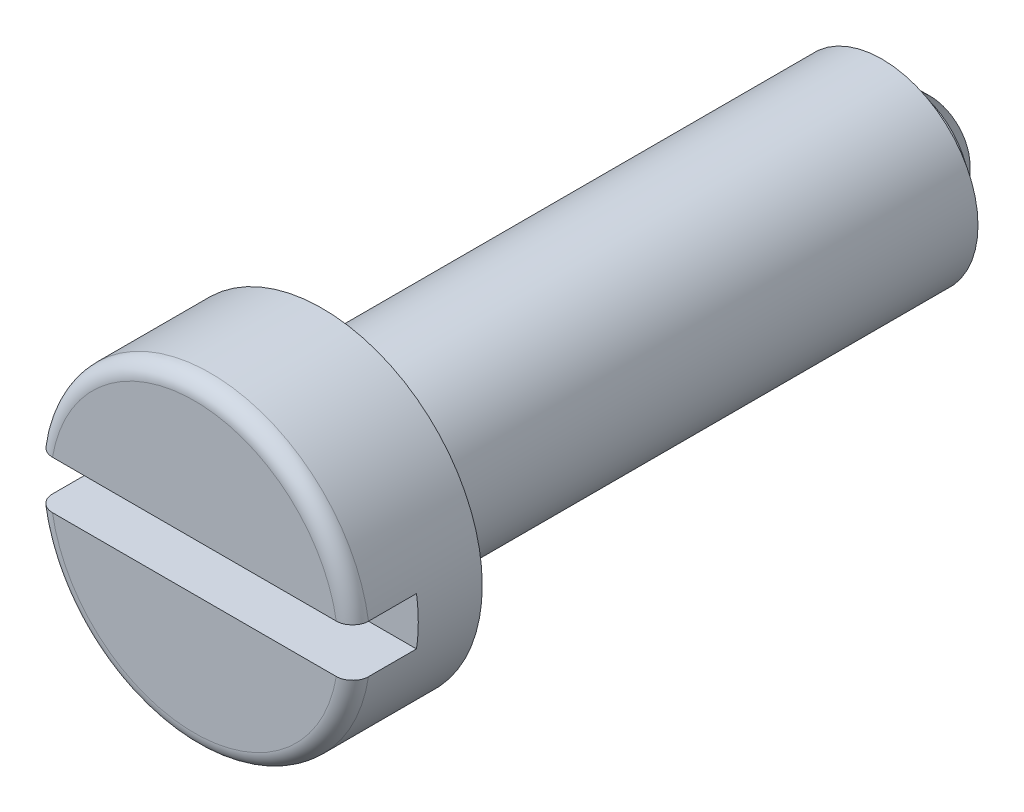
ISO-10303-21;
HEADER;
FILE_DESCRIPTION(('STEP AP214'),'2;1');
FILE_NAME('part.step','',(''),(''),'','','');
FILE_SCHEMA(('AUTOMOTIVE_DESIGN { 1 0 10303 214 1 1 1 1 }'));
ENDSEC;
DATA;
#1=APPLICATION_CONTEXT('core data for automotive mechanical design processes');
#2=APPLICATION_PROTOCOL_DEFINITION('international standard','automotive_design',2000,#1);
#3=PRODUCT_CONTEXT('',#1,'mechanical');
#4=PRODUCT('Part','Part','',(#3));
#5=PRODUCT_RELATED_PRODUCT_CATEGORY('part','',(#4));
#6=PRODUCT_DEFINITION_FORMATION('','',#4);
#7=PRODUCT_DEFINITION_CONTEXT('part definition',#1,'design');
#8=PRODUCT_DEFINITION('design','',#6,#7);
#9=PRODUCT_DEFINITION_SHAPE('','',#8);
#10=(LENGTH_UNIT() NAMED_UNIT(*) SI_UNIT(.MILLI.,.METRE.));
#11=(NAMED_UNIT(*) PLANE_ANGLE_UNIT() SI_UNIT($,.RADIAN.));
#12=(NAMED_UNIT(*) SI_UNIT($,.STERADIAN.) SOLID_ANGLE_UNIT());
#13=UNCERTAINTY_MEASURE_WITH_UNIT(LENGTH_MEASURE(1.E-05),#10,'distance_accuracy_value','');
#14=(GEOMETRIC_REPRESENTATION_CONTEXT(3) GLOBAL_UNCERTAINTY_ASSIGNED_CONTEXT((#13)) GLOBAL_UNIT_ASSIGNED_CONTEXT((#10,
#11,#12)) REPRESENTATION_CONTEXT('',''));
#15=CARTESIAN_POINT('',(0.,0.,0.));
#16=DIRECTION('',(0.,0.,1.));
#17=DIRECTION('',(1.,0.,0.));
#18=AXIS2_PLACEMENT_3D('',#15,#16,#17);
#19=CARTESIAN_POINT('',(0.,0.,-0.1));
#20=DIRECTION('',(0.,0.,-1.));
#21=DIRECTION('',(-1.,0.,0.));
#22=AXIS2_PLACEMENT_3D('',#19,#20,#21);
#23=TOROIDAL_SURFACE('',#22,0.9,0.1);
#24=CARTESIAN_POINT('',(0.887411967464941,-0.15,0.));
#25=CARTESIAN_POINT('',(0.926926603390641,-0.15,0.));
#26=CARTESIAN_POINT('',(0.957983689915386,-0.15,-0.030057713039219));
#27=CARTESIAN_POINT('',(0.988685996664551,-0.15,-0.0597720626184495));
#28=CARTESIAN_POINT('',(0.988685996664551,-0.15,-0.0999999999999371));
#29=B_SPLINE_CURVE_WITH_KNOTS('',2,(#24,#25,#26,#27,#28),.UNSPECIFIED.,.F.,.F.,(3,2,3),(0.,0.5,
1.),.UNSPECIFIED.);
#30=CARTESIAN_POINT('',(0.887411967464942,-0.15,0.));
#31=VERTEX_POINT('',#30);
#32=CARTESIAN_POINT('',(0.988685996664259,-0.15,-0.1));
#33=VERTEX_POINT('',#32);
#34=EDGE_CURVE('E146',#31,#33,#29,.T.);
#35=ORIENTED_EDGE('',*,*,#34,.F.);
#36=CARTESIAN_POINT('',(0.,0.,0.));
#37=DIRECTION('',(0.,0.,1.));
#38=DIRECTION('',(-1.,0.,0.));
#39=AXIS2_PLACEMENT_3D('',#36,#37,#38);
#40=CIRCLE('',#39,0.9);
#41=CARTESIAN_POINT('',(-0.887411967464942,-0.15,0.));
#42=VERTEX_POINT('',#41);
#43=EDGE_CURVE('E201',#42,#31,#40,.T.);
#44=ORIENTED_EDGE('',*,*,#43,.F.);
#45=CARTESIAN_POINT('',(-0.98868599666426,-0.15,-0.1));
#46=CARTESIAN_POINT('',(-0.98868599666426,-0.15,-0.060708177612476));
#47=CARTESIAN_POINT('',(-0.957979701417958,-0.15,-0.0300622207917125));
#48=CARTESIAN_POINT('',(-0.927858291510137,-0.15,8.39985633133145E-13));
#49=CARTESIAN_POINT('',(-0.887411967465139,-0.15,8.39985633133145E-13));
#50=B_SPLINE_CURVE_WITH_KNOTS('',2,(#45,#46,#47,#48,#49),.UNSPECIFIED.,.F.,.F.,(3,2,3),(0.,0.5,
1.),.UNSPECIFIED.);
#51=CARTESIAN_POINT('',(-0.98868599666426,-0.15,-0.1));
#52=VERTEX_POINT('',#51);
#53=EDGE_CURVE('E181',#52,#42,#50,.T.);
#54=ORIENTED_EDGE('',*,*,#53,.F.);
#55=CARTESIAN_POINT('',(0.,0.,-0.1));
#56=DIRECTION('',(0.,0.,-1.));
#57=DIRECTION('',(-1.,0.,0.));
#58=AXIS2_PLACEMENT_3D('',#55,#56,#57);
#59=CIRCLE('',#58,1.);
#60=EDGE_CURVE('E219',#33,#52,#59,.T.);
#61=ORIENTED_EDGE('',*,*,#60,.F.);
#62=EDGE_LOOP('',(#35,#44,#54,#61));
#63=FACE_BOUND('',#62,.T.);
#64=ADVANCED_FACE('F16',(#63),#23,.T.);
#65=CARTESIAN_POINT('',(0.,0.,-0.1));
#66=DIRECTION('',(0.,0.,-1.));
#67=DIRECTION('',(-1.,0.,0.));
#68=AXIS2_PLACEMENT_3D('',#65,#66,#67);
#69=TOROIDAL_SURFACE('',#68,0.9,0.1);
#70=CARTESIAN_POINT('',(-0.887411967464941,0.15,0.));
#71=CARTESIAN_POINT('',(-0.926926603390646,0.15,0.));
#72=CARTESIAN_POINT('',(-0.957983689915386,0.15,-0.030057713039219));
#73=CARTESIAN_POINT('',(-0.988685996664551,0.15,-0.0597720626184485));
#74=CARTESIAN_POINT('',(-0.988685996664551,0.15,-0.0999999999999375));
#75=B_SPLINE_CURVE_WITH_KNOTS('',2,(#70,#71,#72,#73,#74),.UNSPECIFIED.,.F.,.F.,(3,2,3),(0.,0.5,
1.),.UNSPECIFIED.);
#76=CARTESIAN_POINT('',(-0.887411967464942,0.15,0.));
#77=VERTEX_POINT('',#76);
#78=CARTESIAN_POINT('',(-0.98868599666426,0.149999999999998,-0.1));
#79=VERTEX_POINT('',#78);
#80=EDGE_CURVE('E27',#77,#79,#75,.T.);
#81=ORIENTED_EDGE('',*,*,#80,.F.);
#82=CARTESIAN_POINT('',(0.,0.,0.));
#83=DIRECTION('',(0.,0.,1.));
#84=DIRECTION('',(-1.,0.,0.));
#85=AXIS2_PLACEMENT_3D('',#82,#83,#84);
#86=CIRCLE('',#85,0.9);
#87=CARTESIAN_POINT('',(0.887411967464942,0.15,0.));
#88=VERTEX_POINT('',#87);
#89=EDGE_CURVE('E270',#88,#77,#86,.T.);
#90=ORIENTED_EDGE('',*,*,#89,.F.);
#91=CARTESIAN_POINT('',(0.988685996664259,0.15,-0.1));
#92=CARTESIAN_POINT('',(0.988685996664259,0.15,-0.06070817761247));
#93=CARTESIAN_POINT('',(0.957979701417958,0.15,-0.0300622207917125));
#94=CARTESIAN_POINT('',(0.927858291510131,0.15,8.39985633133145E-13));
#95=CARTESIAN_POINT('',(0.88741196746514,0.15,8.39985633133145E-13));
#96=B_SPLINE_CURVE_WITH_KNOTS('',2,(#91,#92,#93,#94,#95),.UNSPECIFIED.,.F.,.F.,(3,2,3),(0.,0.5,
1.),.UNSPECIFIED.);
#97=CARTESIAN_POINT('',(0.988685996664259,0.15,-0.1));
#98=VERTEX_POINT('',#97);
#99=EDGE_CURVE('E231',#98,#88,#96,.T.);
#100=ORIENTED_EDGE('',*,*,#99,.F.);
#101=CARTESIAN_POINT('',(0.,0.,-0.1));
#102=DIRECTION('',(0.,0.,-1.));
#103=DIRECTION('',(-1.,0.,0.));
#104=AXIS2_PLACEMENT_3D('',#101,#102,#103);
#105=CIRCLE('',#104,1.);
#106=EDGE_CURVE('E127',#79,#98,#105,.T.);
#107=ORIENTED_EDGE('',*,*,#106,.F.);
#108=EDGE_LOOP('',(#81,#90,#100,#107));
#109=FACE_BOUND('',#108,.T.);
#110=ADVANCED_FACE('F194',(#109),#69,.T.);
#111=CARTESIAN_POINT('',(0.,0.,-0.4));
#112=DIRECTION('',(0.,0.,-1.));
#113=DIRECTION('',(0.,-1.,0.));
#114=AXIS2_PLACEMENT_3D('',#111,#112,#113);
#115=PLANE('',#114);
#116=DIRECTION('',(-1.,0.,0.));
#117=VECTOR('',#116,1.);
#118=CARTESIAN_POINT('',(-0.988685996664259,-0.15,-0.4));
#119=LINE('',#118,#117);
#120=CARTESIAN_POINT('',(0.988685996664259,-0.15,-0.4));
#121=VERTEX_POINT('',#120);
#122=CARTESIAN_POINT('',(-0.98868599666426,-0.15,-0.4));
#123=VERTEX_POINT('',#122);
#124=EDGE_CURVE('E118',#121,#123,#119,.T.);
#125=ORIENTED_EDGE('',*,*,#124,.F.);
#126=CARTESIAN_POINT('',(0.,0.,-0.4));
#127=DIRECTION('',(0.,0.,-1.));
#128=DIRECTION('',(-1.,0.,0.));
#129=AXIS2_PLACEMENT_3D('',#126,#127,#128);
#130=CIRCLE('',#129,1.);
#131=CARTESIAN_POINT('',(0.988685996664259,0.15,-0.4));
#132=VERTEX_POINT('',#131);
#133=EDGE_CURVE('E116',#132,#121,#130,.T.);
#134=ORIENTED_EDGE('',*,*,#133,.F.);
#135=DIRECTION('',(1.,0.,0.));
#136=VECTOR('',#135,1.);
#137=CARTESIAN_POINT('',(0.988685996664259,0.15,-0.4));
#138=LINE('',#137,#136);
#139=CARTESIAN_POINT('',(-0.98868599666426,0.149999999999998,-0.4));
#140=VERTEX_POINT('',#139);
#141=EDGE_CURVE('E11',#140,#132,#138,.T.);
#142=ORIENTED_EDGE('',*,*,#141,.F.);
#143=CARTESIAN_POINT('',(0.,0.,-0.4));
#144=DIRECTION('',(0.,0.,-1.));
#145=DIRECTION('',(1.,0.,0.));
#146=AXIS2_PLACEMENT_3D('',#143,#144,#145);
#147=CIRCLE('',#146,1.);
#148=EDGE_CURVE('E233',#123,#140,#147,.T.);
#149=ORIENTED_EDGE('',*,*,#148,.F.);
#150=EDGE_LOOP('',(#125,#134,#142,#149));
#151=FACE_BOUND('',#150,.T.);
#152=ADVANCED_FACE('F117',(#151),#115,.F.);
#153=CARTESIAN_POINT('',(0.988685996664259,0.15,-0.4));
#154=DIRECTION('',(0.,-1.,0.));
#155=DIRECTION('',(0.,0.,-1.));
#156=AXIS2_PLACEMENT_3D('',#153,#154,#155);
#157=PLANE('',#156);
#158=DIRECTION('',(0.,0.,1.));
#159=VECTOR('',#158,1.);
#160=CARTESIAN_POINT('',(0.988685996664259,0.15,-0.4));
#161=LINE('',#160,#159);
#162=EDGE_CURVE('E108',#132,#98,#161,.T.);
#163=ORIENTED_EDGE('',*,*,#162,.T.);
#164=ORIENTED_EDGE('',*,*,#99,.T.);
#165=DIRECTION('',(1.,0.,0.));
#166=VECTOR('',#165,1.);
#167=CARTESIAN_POINT('',(0.988685996664259,0.15,0.));
#168=LINE('',#167,#166);
#169=EDGE_CURVE('E275',#77,#88,#168,.T.);
#170=ORIENTED_EDGE('',*,*,#169,.F.);
#171=ORIENTED_EDGE('',*,*,#80,.T.);
#172=DIRECTION('',(0.,0.,1.));
#173=VECTOR('',#172,1.);
#174=CARTESIAN_POINT('',(-0.98868599666426,0.149999999999998,-0.4));
#175=LINE('',#174,#173);
#176=EDGE_CURVE('E111',#140,#79,#175,.T.);
#177=ORIENTED_EDGE('',*,*,#176,.F.);
#178=ORIENTED_EDGE('',*,*,#141,.T.);
#179=EDGE_LOOP('',(#163,#164,#170,#171,#177,#178));
#180=FACE_BOUND('',#179,.T.);
#181=ADVANCED_FACE('F106',(#180),#157,.T.);
#182=CARTESIAN_POINT('',(-0.988685996664259,-0.15,-0.4));
#183=DIRECTION('',(0.,1.,0.));
#184=DIRECTION('',(1.,0.,0.));
#185=AXIS2_PLACEMENT_3D('',#182,#183,#184);
#186=PLANE('',#185);
#187=DIRECTION('',(0.,0.,1.));
#188=VECTOR('',#187,1.);
#189=CARTESIAN_POINT('',(-0.98868599666426,-0.15,-0.4));
#190=LINE('',#189,#188);
#191=EDGE_CURVE('E185',#123,#52,#190,.T.);
#192=ORIENTED_EDGE('',*,*,#191,.T.);
#193=ORIENTED_EDGE('',*,*,#53,.T.);
#194=DIRECTION('',(-1.,0.,0.));
#195=VECTOR('',#194,1.);
#196=CARTESIAN_POINT('',(-0.988685996664259,-0.15,0.));
#197=LINE('',#196,#195);
#198=EDGE_CURVE('E211',#31,#42,#197,.T.);
#199=ORIENTED_EDGE('',*,*,#198,.F.);
#200=ORIENTED_EDGE('',*,*,#34,.T.);
#201=DIRECTION('',(0.,0.,1.));
#202=VECTOR('',#201,1.);
#203=CARTESIAN_POINT('',(0.988685996664259,-0.15,-0.4));
#204=LINE('',#203,#202);
#205=EDGE_CURVE('E210',#121,#33,#204,.T.);
#206=ORIENTED_EDGE('',*,*,#205,.F.);
#207=ORIENTED_EDGE('',*,*,#124,.T.);
#208=EDGE_LOOP('',(#192,#193,#199,#200,#206,#207));
#209=FACE_BOUND('',#208,.T.);
#210=ADVANCED_FACE('F153',(#209),#186,.T.);
#211=CARTESIAN_POINT('',(0.,0.,-4.45));
#212=DIRECTION('',(0.,0.,1.));
#213=DIRECTION('',(1.,0.,0.));
#214=AXIS2_PLACEMENT_3D('',#211,#212,#213);
#215=CONICAL_SURFACE('',#214,0.4,0.785398163397449);
#216=CARTESIAN_POINT('',(0.,0.,-4.45));
#217=DIRECTION('',(0.,0.,1.));
#218=DIRECTION('',(1.,0.,0.));
#219=AXIS2_PLACEMENT_3D('',#216,#217,#218);
#220=CIRCLE('',#219,0.4);
#221=CARTESIAN_POINT('',(0.4,0.,-4.45));
#222=VERTEX_POINT('',#221);
#223=EDGE_CURVE('E262',#222,#222,#220,.T.);
#224=ORIENTED_EDGE('',*,*,#223,.F.);
#225=EDGE_LOOP('',(#224));
#226=FACE_BOUND('',#225,.T.);
#227=CARTESIAN_POINT('',(0.,0.,-4.6));
#228=DIRECTION('',(0.,0.,-1.));
#229=DIRECTION('',(1.,0.,0.));
#230=AXIS2_PLACEMENT_3D('',#227,#228,#229);
#231=CIRCLE('',#230,0.25);
#232=CARTESIAN_POINT('',(0.25,0.,-4.6));
#233=VERTEX_POINT('',#232);
#234=EDGE_CURVE('E38',#233,#233,#231,.T.);
#235=ORIENTED_EDGE('',*,*,#234,.F.);
#236=EDGE_LOOP('',(#235));
#237=FACE_BOUND('',#236,.T.);
#238=ADVANCED_FACE('F163',(#226,#237),#215,.T.);
#239=CARTESIAN_POINT('',(0.,0.,-4.6));
#240=DIRECTION('',(0.,0.,1.));
#241=DIRECTION('',(1.,0.,0.));
#242=AXIS2_PLACEMENT_3D('',#239,#240,#241);
#243=PLANE('',#242);
#244=ORIENTED_EDGE('',*,*,#234,.T.);
#245=EDGE_LOOP('',(#244));
#246=FACE_BOUND('',#245,.T.);
#247=ADVANCED_FACE('F195',(#246),#243,.F.);
#248=CARTESIAN_POINT('',(0.,0.,-4.6));
#249=DIRECTION('',(0.,0.,1.));
#250=DIRECTION('',(1.,0.,0.));
#251=AXIS2_PLACEMENT_3D('',#248,#249,#250);
#252=CYLINDRICAL_SURFACE('',#251,0.4);
#253=CARTESIAN_POINT('',(0.,0.,-4.3));
#254=DIRECTION('',(0.,0.,1.));
#255=DIRECTION('',(1.,0.,0.));
#256=AXIS2_PLACEMENT_3D('',#253,#254,#255);
#257=CIRCLE('',#256,0.4);
#258=CARTESIAN_POINT('',(0.4,0.,-4.3));
#259=VERTEX_POINT('',#258);
#260=EDGE_CURVE('E259',#259,#259,#257,.T.);
#261=ORIENTED_EDGE('',*,*,#260,.F.);
#262=EDGE_LOOP('',(#261));
#263=FACE_BOUND('',#262,.T.);
#264=ORIENTED_EDGE('',*,*,#223,.T.);
#265=EDGE_LOOP('',(#264));
#266=FACE_BOUND('',#265,.T.);
#267=ADVANCED_FACE('F329',(#263,#266),#252,.T.);
#268=CARTESIAN_POINT('',(0.,0.,-4.3));
#269=DIRECTION('',(0.,0.,1.));
#270=DIRECTION('',(1.,0.,0.));
#271=AXIS2_PLACEMENT_3D('',#268,#269,#270);
#272=PLANE('',#271);
#273=CARTESIAN_POINT('',(0.,0.,-4.3));
#274=DIRECTION('',(0.,0.,1.));
#275=DIRECTION('',(1.,0.,0.));
#276=AXIS2_PLACEMENT_3D('',#273,#274,#275);
#277=CIRCLE('',#276,0.6);
#278=CARTESIAN_POINT('',(0.6,0.,-4.3));
#279=VERTEX_POINT('',#278);
#280=EDGE_CURVE('E263',#279,#279,#277,.T.);
#281=ORIENTED_EDGE('',*,*,#280,.F.);
#282=EDGE_LOOP('',(#281));
#283=FACE_BOUND('',#282,.T.);
#284=ORIENTED_EDGE('',*,*,#260,.T.);
#285=EDGE_LOOP('',(#284));
#286=FACE_BOUND('',#285,.T.);
#287=ADVANCED_FACE('F334',(#283,#286),#272,.F.);
#288=CARTESIAN_POINT('',(0.,0.,-4.5));
#289=DIRECTION('',(0.,0.,1.));
#290=DIRECTION('',(1.,0.,0.));
#291=AXIS2_PLACEMENT_3D('',#288,#289,#290);
#292=CYLINDRICAL_SURFACE('',#291,0.6);
#293=CARTESIAN_POINT('',(0.,0.,-0.8));
#294=DIRECTION('',(0.,0.,1.));
#295=DIRECTION('',(1.,0.,0.));
#296=AXIS2_PLACEMENT_3D('',#293,#294,#295);
#297=CIRCLE('',#296,0.6);
#298=CARTESIAN_POINT('',(0.6,0.,-0.8));
#299=VERTEX_POINT('',#298);
#300=EDGE_CURVE('E285',#299,#299,#297,.T.);
#301=ORIENTED_EDGE('',*,*,#300,.F.);
#302=EDGE_LOOP('',(#301));
#303=FACE_BOUND('',#302,.T.);
#304=ORIENTED_EDGE('',*,*,#280,.T.);
#305=EDGE_LOOP('',(#304));
#306=FACE_BOUND('',#305,.T.);
#307=ADVANCED_FACE('F18',(#303,#306),#292,.T.);
#308=CARTESIAN_POINT('',(0.,0.,0.));
#309=DIRECTION('',(0.,0.,-1.));
#310=DIRECTION('',(0.,-1.,0.));
#311=AXIS2_PLACEMENT_3D('',#308,#309,#310);
#312=PLANE('',#311);
#313=ORIENTED_EDGE('',*,*,#169,.T.);
#314=ORIENTED_EDGE('',*,*,#89,.T.);
#315=EDGE_LOOP('',(#313,#314));
#316=FACE_BOUND('',#315,.T.);
#317=ADVANCED_FACE('F375',(#316),#312,.F.);
#318=CARTESIAN_POINT('',(0.,0.,-0.8));
#319=DIRECTION('',(0.,0.,-1.));
#320=DIRECTION('',(0.,-1.,0.));
#321=AXIS2_PLACEMENT_3D('',#318,#319,#320);
#322=PLANE('',#321);
#323=CARTESIAN_POINT('',(0.,0.,-0.8));
#324=DIRECTION('',(0.,0.,-1.));
#325=DIRECTION('',(1.,0.,0.));
#326=AXIS2_PLACEMENT_3D('',#323,#324,#325);
#327=CIRCLE('',#326,1.);
#328=CARTESIAN_POINT('',(1.,0.,-0.8));
#329=VERTEX_POINT('',#328);
#330=EDGE_CURVE('E123',#329,#329,#327,.T.);
#331=ORIENTED_EDGE('',*,*,#330,.T.);
#332=EDGE_LOOP('',(#331));
#333=FACE_BOUND('',#332,.T.);
#334=ORIENTED_EDGE('',*,*,#300,.T.);
#335=EDGE_LOOP('',(#334));
#336=FACE_BOUND('',#335,.T.);
#337=ADVANCED_FACE('F345',(#333,#336),#322,.T.);
#338=CARTESIAN_POINT('',(0.,0.,-0.8));
#339=DIRECTION('',(0.,0.,1.));
#340=DIRECTION('',(1.,0.,0.));
#341=AXIS2_PLACEMENT_3D('',#338,#339,#340);
#342=CYLINDRICAL_SURFACE('',#341,1.);
#343=ORIENTED_EDGE('',*,*,#330,.F.);
#344=EDGE_LOOP('',(#343));
#345=FACE_BOUND('',#344,.T.);
#346=ORIENTED_EDGE('',*,*,#205,.T.);
#347=ORIENTED_EDGE('',*,*,#60,.T.);
#348=ORIENTED_EDGE('',*,*,#191,.F.);
#349=ORIENTED_EDGE('',*,*,#148,.T.);
#350=ORIENTED_EDGE('',*,*,#176,.T.);
#351=ORIENTED_EDGE('',*,*,#106,.T.);
#352=ORIENTED_EDGE('',*,*,#162,.F.);
#353=ORIENTED_EDGE('',*,*,#133,.T.);
#354=EDGE_LOOP('',(#346,#347,#348,#349,#350,#351,#352,#353));
#355=FACE_BOUND('',#354,.T.);
#356=ADVANCED_FACE('F125',(#345,#355),#342,.T.);
#357=CARTESIAN_POINT('',(0.,0.,0.));
#358=DIRECTION('',(0.,0.,-1.));
#359=DIRECTION('',(0.,-1.,0.));
#360=AXIS2_PLACEMENT_3D('',#357,#358,#359);
#361=PLANE('',#360);
#362=ORIENTED_EDGE('',*,*,#198,.T.);
#363=ORIENTED_EDGE('',*,*,#43,.T.);
#364=EDGE_LOOP('',(#362,#363));
#365=FACE_BOUND('',#364,.T.);
#366=ADVANCED_FACE('F344',(#365),#361,.F.);
#367=CLOSED_SHELL('',(#64,#110,#152,#181,#210,#238,#247,#267,#287,#307,#317,#337,#356,#366));
#368=MANIFOLD_SOLID_BREP('B1',#367);
#369=ADVANCED_BREP_SHAPE_REPRESENTATION('',(#18,#368),#14);
#370=SHAPE_DEFINITION_REPRESENTATION(#9,#369);
ENDSEC;
END-ISO-10303-21;
